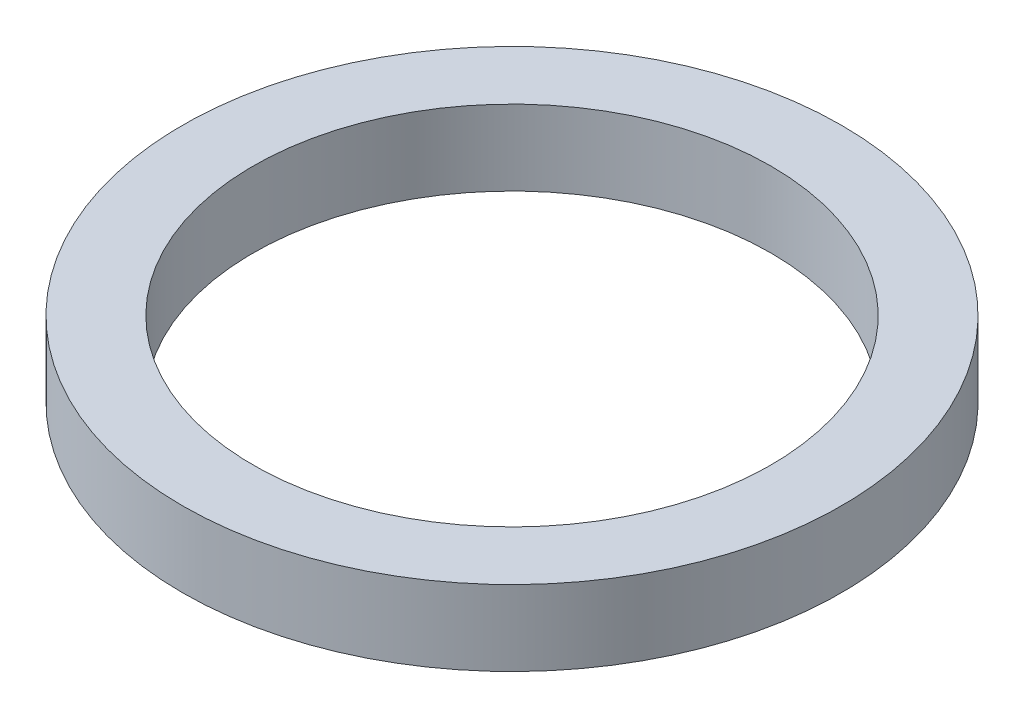
ISO-10303-21;
HEADER;
FILE_DESCRIPTION(('STEP AP214'),'2;1');
FILE_NAME('part.step','',(''),(''),'','','');
FILE_SCHEMA(('AUTOMOTIVE_DESIGN { 1 0 10303 214 1 1 1 1 }'));
ENDSEC;
DATA;
#1=APPLICATION_CONTEXT('core data for automotive mechanical design processes');
#2=APPLICATION_PROTOCOL_DEFINITION('international standard','automotive_design',2000,#1);
#3=PRODUCT_CONTEXT('',#1,'mechanical');
#4=PRODUCT('Part','Part','',(#3));
#5=PRODUCT_RELATED_PRODUCT_CATEGORY('part','',(#4));
#6=PRODUCT_DEFINITION_FORMATION('','',#4);
#7=PRODUCT_DEFINITION_CONTEXT('part definition',#1,'design');
#8=PRODUCT_DEFINITION('design','',#6,#7);
#9=PRODUCT_DEFINITION_SHAPE('','',#8);
#10=(LENGTH_UNIT() NAMED_UNIT(*) SI_UNIT(.MILLI.,.METRE.));
#11=(NAMED_UNIT(*) PLANE_ANGLE_UNIT() SI_UNIT($,.RADIAN.));
#12=(NAMED_UNIT(*) SI_UNIT($,.STERADIAN.) SOLID_ANGLE_UNIT());
#13=UNCERTAINTY_MEASURE_WITH_UNIT(LENGTH_MEASURE(1.E-05),#10,'distance_accuracy_value','');
#14=(GEOMETRIC_REPRESENTATION_CONTEXT(3) GLOBAL_UNCERTAINTY_ASSIGNED_CONTEXT((#13)) GLOBAL_UNIT_ASSIGNED_CONTEXT((#10,
#11,#12)) REPRESENTATION_CONTEXT('',''));
#15=CARTESIAN_POINT('',(0.,0.,0.));
#16=DIRECTION('',(0.,0.,1.));
#17=DIRECTION('',(1.,0.,0.));
#18=AXIS2_PLACEMENT_3D('',#15,#16,#17);
#19=CARTESIAN_POINT('',(0.,0.,0.));
#20=DIRECTION('',(0.,1.,0.));
#21=DIRECTION('',(0.,0.,1.));
#22=AXIS2_PLACEMENT_3D('',#19,#20,#21);
#23=PLANE('',#22);
#24=CARTESIAN_POINT('',(0.,0.,0.));
#25=DIRECTION('',(0.,-1.,0.));
#26=DIRECTION('',(0.,0.,-1.));
#27=AXIS2_PLACEMENT_3D('',#24,#25,#26);
#28=CIRCLE('',#27,55.);
#29=CARTESIAN_POINT('',(0.,0.,-55.));
#30=VERTEX_POINT('',#29);
#31=EDGE_CURVE('E28',#30,#30,#28,.F.);
#32=ORIENTED_EDGE('',*,*,#31,.T.);
#33=EDGE_LOOP('',(#32));
#34=FACE_BOUND('',#33,.T.);
#35=CARTESIAN_POINT('',(0.,0.,0.));
#36=DIRECTION('',(0.,-1.,0.));
#37=DIRECTION('',(0.,0.,-1.));
#38=AXIS2_PLACEMENT_3D('',#35,#36,#37);
#39=CIRCLE('',#38,70.);
#40=CARTESIAN_POINT('',(0.,0.,-70.));
#41=VERTEX_POINT('',#40);
#42=EDGE_CURVE('E19',#41,#41,#39,.F.);
#43=ORIENTED_EDGE('',*,*,#42,.F.);
#44=EDGE_LOOP('',(#43));
#45=FACE_BOUND('',#44,.T.);
#46=ADVANCED_FACE('F16',(#34,#45),#23,.F.);
#47=CARTESIAN_POINT('',(0.,16.,0.));
#48=DIRECTION('',(0.,-1.,0.));
#49=DIRECTION('',(0.,0.,-1.));
#50=AXIS2_PLACEMENT_3D('',#47,#48,#49);
#51=CYLINDRICAL_SURFACE('',#50,70.);
#52=ORIENTED_EDGE('',*,*,#42,.T.);
#53=EDGE_LOOP('',(#52));
#54=FACE_BOUND('',#53,.T.);
#55=CARTESIAN_POINT('',(0.,16.,0.));
#56=DIRECTION('',(0.,-1.,0.));
#57=DIRECTION('',(0.,0.,-1.));
#58=AXIS2_PLACEMENT_3D('',#55,#56,#57);
#59=CIRCLE('',#58,70.);
#60=CARTESIAN_POINT('',(0.,16.,-70.));
#61=VERTEX_POINT('',#60);
#62=EDGE_CURVE('E23',#61,#61,#59,.F.);
#63=ORIENTED_EDGE('',*,*,#62,.F.);
#64=EDGE_LOOP('',(#63));
#65=FACE_BOUND('',#64,.T.);
#66=ADVANCED_FACE('F36',(#54,#65),#51,.T.);
#67=CARTESIAN_POINT('',(0.,16.,0.));
#68=DIRECTION('',(0.,-1.,0.));
#69=DIRECTION('',(0.,0.,-1.));
#70=AXIS2_PLACEMENT_3D('',#67,#68,#69);
#71=CYLINDRICAL_SURFACE('',#70,55.);
#72=CARTESIAN_POINT('',(0.,16.,0.));
#73=DIRECTION('',(0.,-1.,0.));
#74=DIRECTION('',(0.,0.,-1.));
#75=AXIS2_PLACEMENT_3D('',#72,#73,#74);
#76=CIRCLE('',#75,55.);
#77=CARTESIAN_POINT('',(0.,16.,-55.));
#78=VERTEX_POINT('',#77);
#79=EDGE_CURVE('E10',#78,#78,#76,.T.);
#80=ORIENTED_EDGE('',*,*,#79,.F.);
#81=EDGE_LOOP('',(#80));
#82=FACE_BOUND('',#81,.T.);
#83=ORIENTED_EDGE('',*,*,#31,.F.);
#84=EDGE_LOOP('',(#83));
#85=FACE_BOUND('',#84,.T.);
#86=ADVANCED_FACE('F43',(#82,#85),#71,.F.);
#87=CARTESIAN_POINT('',(0.,16.,0.));
#88=DIRECTION('',(0.,1.,0.));
#89=DIRECTION('',(0.,0.,1.));
#90=AXIS2_PLACEMENT_3D('',#87,#88,#89);
#91=PLANE('',#90);
#92=ORIENTED_EDGE('',*,*,#79,.T.);
#93=EDGE_LOOP('',(#92));
#94=FACE_BOUND('',#93,.T.);
#95=ORIENTED_EDGE('',*,*,#62,.T.);
#96=EDGE_LOOP('',(#95));
#97=FACE_BOUND('',#96,.T.);
#98=ADVANCED_FACE('F44',(#94,#97),#91,.T.);
#99=CLOSED_SHELL('',(#46,#66,#86,#98));
#100=MANIFOLD_SOLID_BREP('B1',#99);
#101=ADVANCED_BREP_SHAPE_REPRESENTATION('',(#18,#100),#14);
#102=SHAPE_DEFINITION_REPRESENTATION(#9,#101);
ENDSEC;
END-ISO-10303-21;
